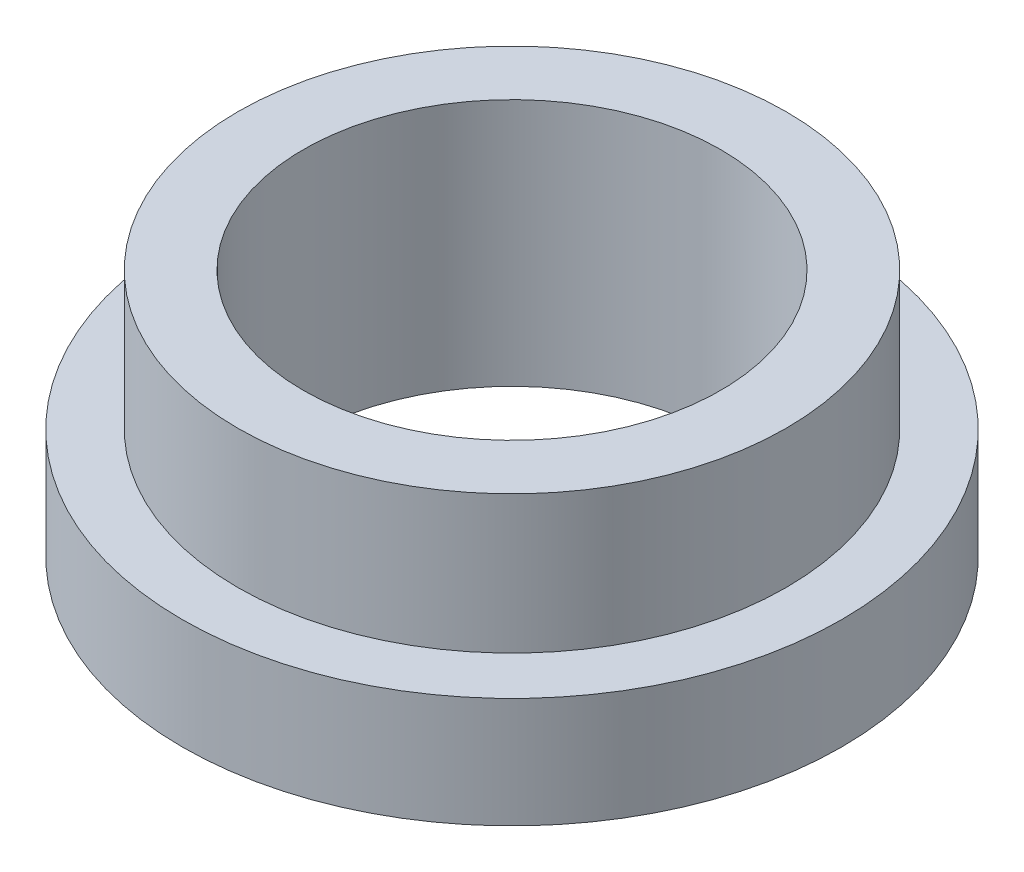
ISO-10303-21;
HEADER;
FILE_DESCRIPTION(('STEP AP214'),'2;1');
FILE_NAME('part.step','',(''),(''),'','','');
FILE_SCHEMA(('AUTOMOTIVE_DESIGN { 1 0 10303 214 1 1 1 1 }'));
ENDSEC;
DATA;
#1=APPLICATION_CONTEXT('core data for automotive mechanical design processes');
#2=APPLICATION_PROTOCOL_DEFINITION('international standard','automotive_design',2000,#1);
#3=PRODUCT_CONTEXT('',#1,'mechanical');
#4=PRODUCT('Part','Part','',(#3));
#5=PRODUCT_RELATED_PRODUCT_CATEGORY('part','',(#4));
#6=PRODUCT_DEFINITION_FORMATION('','',#4);
#7=PRODUCT_DEFINITION_CONTEXT('part definition',#1,'design');
#8=PRODUCT_DEFINITION('design','',#6,#7);
#9=PRODUCT_DEFINITION_SHAPE('','',#8);
#10=(LENGTH_UNIT() NAMED_UNIT(*) SI_UNIT(.MILLI.,.METRE.));
#11=(NAMED_UNIT(*) PLANE_ANGLE_UNIT() SI_UNIT($,.RADIAN.));
#12=(NAMED_UNIT(*) SI_UNIT($,.STERADIAN.) SOLID_ANGLE_UNIT());
#13=UNCERTAINTY_MEASURE_WITH_UNIT(LENGTH_MEASURE(1.E-05),#10,'distance_accuracy_value','');
#14=(GEOMETRIC_REPRESENTATION_CONTEXT(3) GLOBAL_UNCERTAINTY_ASSIGNED_CONTEXT((#13)) GLOBAL_UNIT_ASSIGNED_CONTEXT((#10,
#11,#12)) REPRESENTATION_CONTEXT('',''));
#15=CARTESIAN_POINT('',(0.,0.,0.));
#16=DIRECTION('',(0.,0.,1.));
#17=DIRECTION('',(1.,0.,0.));
#18=AXIS2_PLACEMENT_3D('',#15,#16,#17);
#19=CARTESIAN_POINT('',(-4.78,0.,0.));
#20=DIRECTION('',(0.,1.,0.));
#21=DIRECTION('',(0.,0.,1.));
#22=AXIS2_PLACEMENT_3D('',#19,#20,#21);
#23=PLANE('',#22);
#24=CARTESIAN_POINT('',(0.,0.,0.));
#25=DIRECTION('',(0.,-1.,0.));
#26=DIRECTION('',(0.,0.,-1.));
#27=AXIS2_PLACEMENT_3D('',#24,#25,#26);
#28=CIRCLE('',#27,3.025);
#29=CARTESIAN_POINT('',(0.,0.,-3.025));
#30=VERTEX_POINT('',#29);
#31=EDGE_CURVE('E10',#30,#30,#28,.T.);
#32=ORIENTED_EDGE('',*,*,#31,.F.);
#33=EDGE_LOOP('',(#32));
#34=FACE_BOUND('',#33,.T.);
#35=CARTESIAN_POINT('',(0.,0.,0.));
#36=DIRECTION('',(0.,-1.,0.));
#37=DIRECTION('',(0.,0.,-1.));
#38=AXIS2_PLACEMENT_3D('',#35,#36,#37);
#39=CIRCLE('',#38,4.78);
#40=CARTESIAN_POINT('',(0.,0.,-4.78));
#41=VERTEX_POINT('',#40);
#42=EDGE_CURVE('E52',#41,#41,#39,.T.);
#43=ORIENTED_EDGE('',*,*,#42,.T.);
#44=EDGE_LOOP('',(#43));
#45=FACE_BOUND('',#44,.T.);
#46=ADVANCED_FACE('F30',(#34,#45),#23,.F.);
#47=CARTESIAN_POINT('',(0.,0.,0.));
#48=DIRECTION('',(0.,-1.,0.));
#49=DIRECTION('',(0.,0.,-1.));
#50=AXIS2_PLACEMENT_3D('',#47,#48,#49);
#51=CYLINDRICAL_SURFACE('',#50,3.025);
#52=CARTESIAN_POINT('',(0.,3.6,0.));
#53=DIRECTION('',(0.,-1.,0.));
#54=DIRECTION('',(0.,0.,-1.));
#55=AXIS2_PLACEMENT_3D('',#52,#53,#54);
#56=CIRCLE('',#55,3.025);
#57=CARTESIAN_POINT('',(0.,3.6,-3.025));
#58=VERTEX_POINT('',#57);
#59=EDGE_CURVE('E36',#58,#58,#56,.T.);
#60=ORIENTED_EDGE('',*,*,#59,.F.);
#61=EDGE_LOOP('',(#60));
#62=FACE_BOUND('',#61,.T.);
#63=ORIENTED_EDGE('',*,*,#31,.T.);
#64=EDGE_LOOP('',(#63));
#65=FACE_BOUND('',#64,.T.);
#66=ADVANCED_FACE('F77',(#62,#65),#51,.F.);
#67=CARTESIAN_POINT('',(-3.025,3.6,0.));
#68=DIRECTION('',(0.,-1.,0.));
#69=DIRECTION('',(0.,0.,-1.));
#70=AXIS2_PLACEMENT_3D('',#67,#68,#69);
#71=PLANE('',#70);
#72=CARTESIAN_POINT('',(0.,3.6,0.));
#73=DIRECTION('',(0.,-1.,0.));
#74=DIRECTION('',(0.,0.,-1.));
#75=AXIS2_PLACEMENT_3D('',#72,#73,#74);
#76=CIRCLE('',#75,3.975);
#77=CARTESIAN_POINT('',(0.,3.6,-3.975));
#78=VERTEX_POINT('',#77);
#79=EDGE_CURVE('E40',#78,#78,#76,.T.);
#80=ORIENTED_EDGE('',*,*,#79,.F.);
#81=EDGE_LOOP('',(#80));
#82=FACE_BOUND('',#81,.T.);
#83=ORIENTED_EDGE('',*,*,#59,.T.);
#84=EDGE_LOOP('',(#83));
#85=FACE_BOUND('',#84,.T.);
#86=ADVANCED_FACE('F72',(#82,#85),#71,.F.);
#87=CARTESIAN_POINT('',(0.,0.,0.));
#88=DIRECTION('',(0.,-1.,0.));
#89=DIRECTION('',(0.,0.,-1.));
#90=AXIS2_PLACEMENT_3D('',#87,#88,#89);
#91=CYLINDRICAL_SURFACE('',#90,3.975);
#92=CARTESIAN_POINT('',(0.,1.6,0.));
#93=DIRECTION('',(0.,-1.,0.));
#94=DIRECTION('',(0.,0.,-1.));
#95=AXIS2_PLACEMENT_3D('',#92,#93,#94);
#96=CIRCLE('',#95,3.975);
#97=CARTESIAN_POINT('',(0.,1.6,-3.975));
#98=VERTEX_POINT('',#97);
#99=EDGE_CURVE('E44',#98,#98,#96,.T.);
#100=ORIENTED_EDGE('',*,*,#99,.F.);
#101=EDGE_LOOP('',(#100));
#102=FACE_BOUND('',#101,.T.);
#103=ORIENTED_EDGE('',*,*,#79,.T.);
#104=EDGE_LOOP('',(#103));
#105=FACE_BOUND('',#104,.T.);
#106=ADVANCED_FACE('F66',(#102,#105),#91,.T.);
#107=CARTESIAN_POINT('',(-3.975,1.6,0.));
#108=DIRECTION('',(0.,-1.,0.));
#109=DIRECTION('',(0.,0.,-1.));
#110=AXIS2_PLACEMENT_3D('',#107,#108,#109);
#111=PLANE('',#110);
#112=CARTESIAN_POINT('',(0.,1.6,0.));
#113=DIRECTION('',(0.,-1.,0.));
#114=DIRECTION('',(0.,0.,-1.));
#115=AXIS2_PLACEMENT_3D('',#112,#113,#114);
#116=CIRCLE('',#115,4.78);
#117=CARTESIAN_POINT('',(0.,1.6,-4.78));
#118=VERTEX_POINT('',#117);
#119=EDGE_CURVE('E49',#118,#118,#116,.T.);
#120=ORIENTED_EDGE('',*,*,#119,.F.);
#121=EDGE_LOOP('',(#120));
#122=FACE_BOUND('',#121,.T.);
#123=ORIENTED_EDGE('',*,*,#99,.T.);
#124=EDGE_LOOP('',(#123));
#125=FACE_BOUND('',#124,.T.);
#126=ADVANCED_FACE('F60',(#122,#125),#111,.F.);
#127=CARTESIAN_POINT('',(0.,0.,0.));
#128=DIRECTION('',(0.,-1.,0.));
#129=DIRECTION('',(0.,0.,-1.));
#130=AXIS2_PLACEMENT_3D('',#127,#128,#129);
#131=CYLINDRICAL_SURFACE('',#130,4.78);
#132=ORIENTED_EDGE('',*,*,#42,.F.);
#133=EDGE_LOOP('',(#132));
#134=FACE_BOUND('',#133,.T.);
#135=ORIENTED_EDGE('',*,*,#119,.T.);
#136=EDGE_LOOP('',(#135));
#137=FACE_BOUND('',#136,.T.);
#138=ADVANCED_FACE('F57',(#134,#137),#131,.T.);
#139=CLOSED_SHELL('',(#46,#66,#86,#106,#126,#138));
#140=MANIFOLD_SOLID_BREP('B2',#139);
#141=ADVANCED_BREP_SHAPE_REPRESENTATION('',(#18,#140),#14);
#142=SHAPE_DEFINITION_REPRESENTATION(#9,#141);
ENDSEC;
END-ISO-10303-21;
